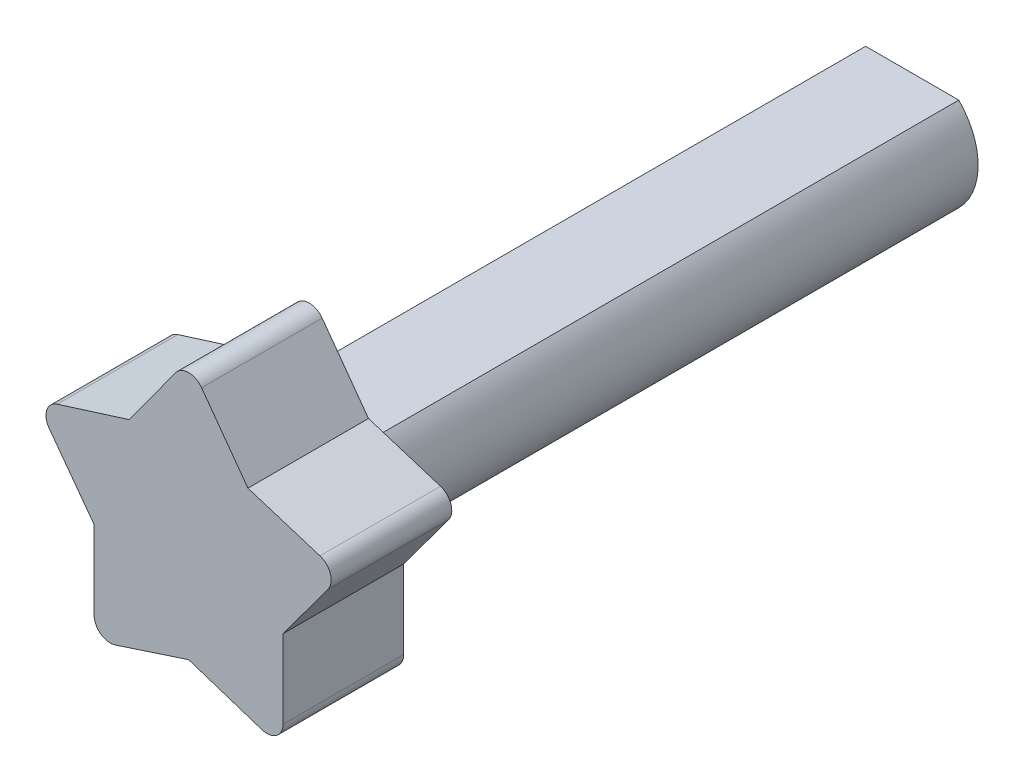
ISO-10303-21;
HEADER;
FILE_DESCRIPTION(('STEP AP214'),'2;1');
FILE_NAME('part.step','',(''),(''),'','','');
FILE_SCHEMA(('AUTOMOTIVE_DESIGN { 1 0 10303 214 1 1 1 1 }'));
ENDSEC;
DATA;
#1=APPLICATION_CONTEXT('core data for automotive mechanical design processes');
#2=APPLICATION_PROTOCOL_DEFINITION('international standard','automotive_design',2000,#1);
#3=PRODUCT_CONTEXT('',#1,'mechanical');
#4=PRODUCT('Part','Part','',(#3));
#5=PRODUCT_RELATED_PRODUCT_CATEGORY('part','',(#4));
#6=PRODUCT_DEFINITION_FORMATION('','',#4);
#7=PRODUCT_DEFINITION_CONTEXT('part definition',#1,'design');
#8=PRODUCT_DEFINITION('design','',#6,#7);
#9=PRODUCT_DEFINITION_SHAPE('','',#8);
#10=(LENGTH_UNIT() NAMED_UNIT(*) SI_UNIT(.MILLI.,.METRE.));
#11=(NAMED_UNIT(*) PLANE_ANGLE_UNIT() SI_UNIT($,.RADIAN.));
#12=(NAMED_UNIT(*) SI_UNIT($,.STERADIAN.) SOLID_ANGLE_UNIT());
#13=UNCERTAINTY_MEASURE_WITH_UNIT(LENGTH_MEASURE(1.E-05),#10,'distance_accuracy_value','');
#14=(GEOMETRIC_REPRESENTATION_CONTEXT(3) GLOBAL_UNCERTAINTY_ASSIGNED_CONTEXT((#13)) GLOBAL_UNIT_ASSIGNED_CONTEXT((#10,
#11,#12)) REPRESENTATION_CONTEXT('',''));
#15=CARTESIAN_POINT('',(0.,0.,0.));
#16=DIRECTION('',(0.,0.,1.));
#17=DIRECTION('',(1.,0.,0.));
#18=AXIS2_PLACEMENT_3D('',#15,#16,#17);
#19=CARTESIAN_POINT('',(0.0183730462436187,0.0659208005755266,-114.3));
#20=DIRECTION('',(0.,0.,1.));
#21=DIRECTION('',(1.,0.,0.));
#22=AXIS2_PLACEMENT_3D('',#19,#20,#21);
#23=CYLINDRICAL_SURFACE('',#22,10.414);
#24=DIRECTION('',(0.,0.,1.));
#25=VECTOR('',#24,1.);
#26=CARTESIAN_POINT('',(7.37782542910922,7.43408587909636,-114.3));
#27=LINE('',#26,#25);
#28=CARTESIAN_POINT('',(7.37782542910922,7.43408587909636,-114.3));
#29=VERTEX_POINT('',#28);
#30=CARTESIAN_POINT('',(7.37782542910922,7.43408587909636,-19.05));
#31=VERTEX_POINT('',#30);
#32=EDGE_CURVE('E44',#29,#31,#27,.T.);
#33=ORIENTED_EDGE('',*,*,#32,.T.);
#34=CARTESIAN_POINT('',(0.0183730462436187,0.0659208005755266,-19.05));
#35=DIRECTION('',(0.,0.,1.));
#36=DIRECTION('',(1.,0.,0.));
#37=AXIS2_PLACEMENT_3D('',#34,#35,#36);
#38=CIRCLE('',#37,10.414);
#39=CARTESIAN_POINT('',(7.37782542910922,-7.3022442779453,-19.05));
#40=VERTEX_POINT('',#39);
#41=EDGE_CURVE('E58',#40,#31,#38,.T.);
#42=ORIENTED_EDGE('',*,*,#41,.F.);
#43=DIRECTION('',(0.,0.,1.));
#44=VECTOR('',#43,1.);
#45=CARTESIAN_POINT('',(7.37782542910922,-7.3022442779453,-114.3));
#46=LINE('',#45,#44);
#47=CARTESIAN_POINT('',(7.37782542910922,-7.3022442779453,-114.3));
#48=VERTEX_POINT('',#47);
#49=EDGE_CURVE('E11',#48,#40,#46,.T.);
#50=ORIENTED_EDGE('',*,*,#49,.F.);
#51=CARTESIAN_POINT('',(0.0183730462436187,0.0659208005755266,-114.3));
#52=DIRECTION('',(0.,0.,1.));
#53=DIRECTION('',(1.,0.,0.));
#54=AXIS2_PLACEMENT_3D('',#51,#52,#53);
#55=CIRCLE('',#54,10.414);
#56=EDGE_CURVE('E315',#48,#29,#55,.T.);
#57=ORIENTED_EDGE('',*,*,#56,.T.);
#58=EDGE_LOOP('',(#33,#42,#50,#57));
#59=FACE_BOUND('',#58,.T.);
#60=ADVANCED_FACE('F41',(#59),#23,.T.);
#61=CARTESIAN_POINT('',(-7.34107933662198,-7.3022442779453,-114.3));
#62=DIRECTION('',(0.,-1.,0.));
#63=DIRECTION('',(0.,0.,-1.));
#64=AXIS2_PLACEMENT_3D('',#61,#62,#63);
#65=PLANE('',#64);
#66=ORIENTED_EDGE('',*,*,#49,.T.);
#67=DIRECTION('',(1.,0.,0.));
#68=VECTOR('',#67,1.);
#69=CARTESIAN_POINT('',(0.,-7.3022442779453,-19.05));
#70=LINE('',#69,#68);
#71=CARTESIAN_POINT('',(-7.34107933662199,-7.3022442779453,-19.05));
#72=VERTEX_POINT('',#71);
#73=EDGE_CURVE('E185',#72,#40,#70,.T.);
#74=ORIENTED_EDGE('',*,*,#73,.F.);
#75=DIRECTION('',(0.,0.,1.));
#76=VECTOR('',#75,1.);
#77=CARTESIAN_POINT('',(-7.34107933662199,-7.3022442779453,-114.3));
#78=LINE('',#77,#76);
#79=CARTESIAN_POINT('',(-7.34107933662199,-7.3022442779453,-114.3));
#80=VERTEX_POINT('',#79);
#81=EDGE_CURVE('E50',#80,#72,#78,.T.);
#82=ORIENTED_EDGE('',*,*,#81,.F.);
#83=DIRECTION('',(1.,0.,0.));
#84=VECTOR('',#83,1.);
#85=CARTESIAN_POINT('',(-7.34107933662198,-7.3022442779453,-114.3));
#86=LINE('',#85,#84);
#87=EDGE_CURVE('E365',#80,#48,#86,.T.);
#88=ORIENTED_EDGE('',*,*,#87,.T.);
#89=EDGE_LOOP('',(#66,#74,#82,#88));
#90=FACE_BOUND('',#89,.T.);
#91=ADVANCED_FACE('F388',(#90),#65,.T.);
#92=CARTESIAN_POINT('',(0.0183730462436187,0.0659208005755266,-114.3));
#93=DIRECTION('',(0.,0.,1.));
#94=DIRECTION('',(1.,0.,0.));
#95=AXIS2_PLACEMENT_3D('',#92,#93,#94);
#96=CYLINDRICAL_SURFACE('',#95,10.414);
#97=ORIENTED_EDGE('',*,*,#81,.T.);
#98=CARTESIAN_POINT('',(0.0183730462436187,0.0659208005755266,-19.05));
#99=DIRECTION('',(0.,0.,1.));
#100=DIRECTION('',(1.,0.,0.));
#101=AXIS2_PLACEMENT_3D('',#98,#99,#100);
#102=CIRCLE('',#101,10.414);
#103=CARTESIAN_POINT('',(-7.34107933662198,7.43408587909635,-19.05));
#104=VERTEX_POINT('',#103);
#105=EDGE_CURVE('E252',#104,#72,#102,.T.);
#106=ORIENTED_EDGE('',*,*,#105,.F.);
#107=DIRECTION('',(0.,0.,1.));
#108=VECTOR('',#107,1.);
#109=CARTESIAN_POINT('',(-7.34107933662198,7.43408587909636,-114.3));
#110=LINE('',#109,#108);
#111=CARTESIAN_POINT('',(-7.34107933662198,7.43408587909636,-114.3));
#112=VERTEX_POINT('',#111);
#113=EDGE_CURVE('E371',#112,#104,#110,.T.);
#114=ORIENTED_EDGE('',*,*,#113,.F.);
#115=CARTESIAN_POINT('',(0.0183730462436187,0.0659208005755266,-114.3));
#116=DIRECTION('',(0.,0.,1.));
#117=DIRECTION('',(1.,0.,0.));
#118=AXIS2_PLACEMENT_3D('',#115,#116,#117);
#119=CIRCLE('',#118,10.414);
#120=EDGE_CURVE('E361',#112,#80,#119,.T.);
#121=ORIENTED_EDGE('',*,*,#120,.T.);
#122=EDGE_LOOP('',(#97,#106,#114,#121));
#123=FACE_BOUND('',#122,.T.);
#124=ADVANCED_FACE('F384',(#123),#96,.T.);
#125=CARTESIAN_POINT('',(-7.34107933662198,7.43408587909636,-114.3));
#126=DIRECTION('',(0.,1.,0.));
#127=DIRECTION('',(0.,0.,1.));
#128=AXIS2_PLACEMENT_3D('',#125,#126,#127);
#129=PLANE('',#128);
#130=ORIENTED_EDGE('',*,*,#113,.T.);
#131=DIRECTION('',(-1.,0.,0.));
#132=VECTOR('',#131,1.);
#133=CARTESIAN_POINT('',(0.,7.43408587909636,-19.05));
#134=LINE('',#133,#132);
#135=EDGE_CURVE('E255',#31,#104,#134,.T.);
#136=ORIENTED_EDGE('',*,*,#135,.F.);
#137=ORIENTED_EDGE('',*,*,#32,.F.);
#138=DIRECTION('',(-1.,0.,0.));
#139=VECTOR('',#138,1.);
#140=CARTESIAN_POINT('',(-7.34107933662198,7.43408587909636,-114.3));
#141=LINE('',#140,#139);
#142=EDGE_CURVE('E357',#29,#112,#141,.T.);
#143=ORIENTED_EDGE('',*,*,#142,.T.);
#144=EDGE_LOOP('',(#130,#136,#137,#143));
#145=FACE_BOUND('',#144,.T.);
#146=ADVANCED_FACE('F378',(#145),#129,.T.);
#147=CARTESIAN_POINT('',(0.0183730462436187,0.0659208005755266,-114.3));
#148=DIRECTION('',(0.,0.,1.));
#149=DIRECTION('',(1.,0.,0.));
#150=AXIS2_PLACEMENT_3D('',#147,#148,#149);
#151=PLANE('',#150);
#152=ORIENTED_EDGE('',*,*,#56,.F.);
#153=ORIENTED_EDGE('',*,*,#87,.F.);
#154=ORIENTED_EDGE('',*,*,#120,.F.);
#155=ORIENTED_EDGE('',*,*,#142,.F.);
#156=EDGE_LOOP('',(#152,#153,#154,#155));
#157=FACE_BOUND('',#156,.T.);
#158=ADVANCED_FACE('F381',(#157),#151,.F.);
#159=CARTESIAN_POINT('',(0.,21.0692264092509,-19.05));
#160=DIRECTION('',(0.,0.,1.));
#161=DIRECTION('',(1.,0.,0.));
#162=AXIS2_PLACEMENT_3D('',#159,#160,#161);
#163=CYLINDRICAL_SURFACE('',#162,2.54);
#164=CARTESIAN_POINT('',(0.,21.0692264092509,0.));
#165=DIRECTION('',(0.,0.,1.));
#166=DIRECTION('',(1.,0.,0.));
#167=AXIS2_PLACEMENT_3D('',#164,#165,#166);
#168=CIRCLE('',#167,2.54);
#169=CARTESIAN_POINT('',(2.05490316571237,22.5622009500738,0.));
#170=VERTEX_POINT('',#169);
#171=CARTESIAN_POINT('',(-2.05490316571239,22.5622009500738,0.));
#172=VERTEX_POINT('',#171);
#173=EDGE_CURVE('E262',#170,#172,#168,.T.);
#174=ORIENTED_EDGE('',*,*,#173,.F.);
#175=DIRECTION('',(0.,0.,1.));
#176=VECTOR('',#175,1.);
#177=CARTESIAN_POINT('',(2.05490316571237,22.5622009500738,-19.05));
#178=LINE('',#177,#176);
#179=CARTESIAN_POINT('',(2.05490316571237,22.5622009500738,-19.05));
#180=VERTEX_POINT('',#179);
#181=EDGE_CURVE('E197',#180,#170,#178,.T.);
#182=ORIENTED_EDGE('',*,*,#181,.F.);
#183=CARTESIAN_POINT('',(0.,21.0692264092509,-19.05));
#184=DIRECTION('',(0.,0.,1.));
#185=DIRECTION('',(1.,0.,0.));
#186=AXIS2_PLACEMENT_3D('',#183,#184,#185);
#187=CIRCLE('',#186,2.54);
#188=CARTESIAN_POINT('',(-2.05490316571239,22.5622009500738,-19.05));
#189=VERTEX_POINT('',#188);
#190=EDGE_CURVE('E190',#180,#189,#187,.T.);
#191=ORIENTED_EDGE('',*,*,#190,.T.);
#192=DIRECTION('',(0.,0.,1.));
#193=VECTOR('',#192,1.);
#194=CARTESIAN_POINT('',(-2.05490316571239,22.5622009500738,-19.05));
#195=LINE('',#194,#193);
#196=EDGE_CURVE('E173',#189,#172,#195,.T.);
#197=ORIENTED_EDGE('',*,*,#196,.T.);
#198=EDGE_LOOP('',(#174,#182,#191,#197));
#199=FACE_BOUND('',#198,.T.);
#200=ADVANCED_FACE('F196',(#199),#163,.T.);
#201=CARTESIAN_POINT('',(12.0739157006204,8.77221323605231,-19.05));
#202=DIRECTION('',(-0.809016994374948,-0.587785252292472,0.));
#203=DIRECTION('',(0.587785252292472,-0.809016994374948,0.));
#204=AXIS2_PLACEMENT_3D('',#201,#202,#203);
#205=PLANE('',#204);
#206=DIRECTION('',(0.587785252292472,-0.809016994374948,0.));
#207=VECTOR('',#206,1.);
#208=CARTESIAN_POINT('',(12.0739157006204,8.77221323605231,0.));
#209=LINE('',#208,#207);
#210=CARTESIAN_POINT('',(9.37321435239456,12.4894097443425,0.));
#211=VERTEX_POINT('',#210);
#212=EDGE_CURVE('E200',#170,#211,#209,.T.);
#213=ORIENTED_EDGE('',*,*,#212,.T.);
#214=DIRECTION('',(0.,0.,1.));
#215=VECTOR('',#214,1.);
#216=CARTESIAN_POINT('',(9.37321435239456,12.4894097443425,-19.05));
#217=LINE('',#216,#215);
#218=CARTESIAN_POINT('',(9.37321435239456,12.4894097443425,-19.05));
#219=VERTEX_POINT('',#218);
#220=EDGE_CURVE('E316',#219,#211,#217,.T.);
#221=ORIENTED_EDGE('',*,*,#220,.F.);
#222=DIRECTION('',(0.587785252292472,-0.809016994374948,0.));
#223=VECTOR('',#222,1.);
#224=CARTESIAN_POINT('',(12.0739157006204,8.77221323605231,-19.05));
#225=LINE('',#224,#223);
#226=EDGE_CURVE('E249',#180,#219,#225,.T.);
#227=ORIENTED_EDGE('',*,*,#226,.F.);
#228=ORIENTED_EDGE('',*,*,#181,.T.);
#229=EDGE_LOOP('',(#213,#221,#227,#228));
#230=FACE_BOUND('',#229,.T.);
#231=ADVANCED_FACE('F406',(#230),#205,.F.);
#232=CARTESIAN_POINT('',(4.41485215354041,14.047702691738,-19.05));
#233=DIRECTION('',(0.299817936372512,0.953996438687969,0.));
#234=DIRECTION('',(-0.953996438687969,0.299817936372512,0.));
#235=AXIS2_PLACEMENT_3D('',#232,#233,#234);
#236=PLANE('',#235);
#237=DIRECTION('',(-0.953996438687969,0.299817936372512,0.));
#238=VECTOR('',#237,1.);
#239=CARTESIAN_POINT('',(4.41485215354041,14.047702691738,0.));
#240=LINE('',#239,#238);
#241=CARTESIAN_POINT('',(20.7505298588902,8.91379549854107,0.));
#242=VERTEX_POINT('',#241);
#243=EDGE_CURVE('E204',#242,#211,#240,.T.);
#244=ORIENTED_EDGE('',*,*,#243,.F.);
#245=DIRECTION('',(0.,0.,1.));
#246=VECTOR('',#245,1.);
#247=CARTESIAN_POINT('',(20.7505298588902,8.91379549854107,-19.05));
#248=LINE('',#247,#246);
#249=CARTESIAN_POINT('',(20.7505298588902,8.91379549854107,-19.05));
#250=VERTEX_POINT('',#249);
#251=EDGE_CURVE('E319',#250,#242,#248,.T.);
#252=ORIENTED_EDGE('',*,*,#251,.F.);
#253=DIRECTION('',(-0.953996438687969,0.299817936372512,0.));
#254=VECTOR('',#253,1.);
#255=CARTESIAN_POINT('',(4.41485215354041,14.047702691738,-19.05));
#256=LINE('',#255,#254);
#257=EDGE_CURVE('E245',#250,#219,#256,.T.);
#258=ORIENTED_EDGE('',*,*,#257,.T.);
#259=ORIENTED_EDGE('',*,*,#220,.T.);
#260=EDGE_LOOP('',(#244,#252,#258,#259));
#261=FACE_BOUND('',#260,.T.);
#262=ADVANCED_FACE('F454',(#261),#236,.T.);
#263=CARTESIAN_POINT('',(19.988992300504,6.49064454427362,-19.05));
#264=DIRECTION('',(0.,0.,1.));
#265=DIRECTION('',(1.,0.,0.));
#266=AXIS2_PLACEMENT_3D('',#263,#264,#265);
#267=CYLINDRICAL_SURFACE('',#266,2.54);
#268=CARTESIAN_POINT('',(19.988992300504,6.49064454427362,0.));
#269=DIRECTION('',(0.,0.,1.));
#270=DIRECTION('',(1.,0.,0.));
#271=AXIS2_PLACEMENT_3D('',#268,#269,#270);
#272=CIRCLE('',#271,2.54);
#273=CARTESIAN_POINT('',(22.0321231029114,4.98159963962222,0.));
#274=VERTEX_POINT('',#273);
#275=EDGE_CURVE('E306',#274,#242,#272,.T.);
#276=ORIENTED_EDGE('',*,*,#275,.F.);
#277=DIRECTION('',(0.,0.,1.));
#278=VECTOR('',#277,1.);
#279=CARTESIAN_POINT('',(22.0321231029114,4.98159963962222,-19.05));
#280=LINE('',#279,#278);
#281=CARTESIAN_POINT('',(22.0321231029114,4.98159963962222,-19.05));
#282=VERTEX_POINT('',#281);
#283=EDGE_CURVE('E322',#282,#274,#280,.T.);
#284=ORIENTED_EDGE('',*,*,#283,.F.);
#285=CARTESIAN_POINT('',(19.988992300504,6.49064454427362,-19.05));
#286=DIRECTION('',(0.,0.,1.));
#287=DIRECTION('',(1.,0.,0.));
#288=AXIS2_PLACEMENT_3D('',#285,#286,#287);
#289=CIRCLE('',#288,2.54);
#290=EDGE_CURVE('E241',#282,#250,#289,.T.);
#291=ORIENTED_EDGE('',*,*,#290,.T.);
#292=ORIENTED_EDGE('',*,*,#251,.T.);
#293=EDGE_LOOP('',(#276,#284,#291,#292));
#294=FACE_BOUND('',#293,.T.);
#295=ADVANCED_FACE('F450',(#294),#267,.T.);
#296=CARTESIAN_POINT('',(11.8747878872972,-8.77065146001795,-19.05));
#297=DIRECTION('',(-0.804382205672187,0.594112167185581,0.));
#298=DIRECTION('',(-0.594112167185581,-0.804382205672187,0.));
#299=AXIS2_PLACEMENT_3D('',#296,#297,#298);
#300=PLANE('',#299);
#301=DIRECTION('',(-0.594112167185581,-0.804382205672187,0.));
#302=VECTOR('',#301,1.);
#303=CARTESIAN_POINT('',(11.8747878872972,-8.77065146001795,0.));
#304=LINE('',#303,#302);
#305=CARTESIAN_POINT('',(14.9241805605687,-4.64200818360349,0.));
#306=VERTEX_POINT('',#305);
#307=EDGE_CURVE('E302',#274,#306,#304,.T.);
#308=ORIENTED_EDGE('',*,*,#307,.T.);
#309=DIRECTION('',(0.,0.,1.));
#310=VECTOR('',#309,1.);
#311=CARTESIAN_POINT('',(14.9241805605687,-4.64200818360349,-19.05));
#312=LINE('',#311,#310);
#313=CARTESIAN_POINT('',(14.9241805605687,-4.64200818360349,-19.05));
#314=VERTEX_POINT('',#313);
#315=EDGE_CURVE('E325',#314,#306,#312,.T.);
#316=ORIENTED_EDGE('',*,*,#315,.F.);
#317=DIRECTION('',(-0.594112167185581,-0.804382205672187,0.));
#318=VECTOR('',#317,1.);
#319=CARTESIAN_POINT('',(11.8747878872972,-8.77065146001795,-19.05));
#320=LINE('',#319,#318);
#321=EDGE_CURVE('E238',#282,#314,#320,.T.);
#322=ORIENTED_EDGE('',*,*,#321,.F.);
#323=ORIENTED_EDGE('',*,*,#283,.T.);
#324=EDGE_LOOP('',(#308,#316,#322,#323));
#325=FACE_BOUND('',#324,.T.);
#326=ADVANCED_FACE('F446',(#325),#300,.F.);
#327=CARTESIAN_POINT('',(14.9241805605687,0.,-19.05));
#328=DIRECTION('',(1.,0.,0.));
#329=DIRECTION('',(0.,0.,-1.));
#330=AXIS2_PLACEMENT_3D('',#327,#328,#329);
#331=PLANE('',#330);
#332=DIRECTION('',(0.,1.,0.));
#333=VECTOR('',#332,1.);
#334=CARTESIAN_POINT('',(14.9241805605687,0.,0.));
#335=LINE('',#334,#333);
#336=CARTESIAN_POINT('',(14.9241805605687,-17.0385844841447,0.));
#337=VERTEX_POINT('',#336);
#338=EDGE_CURVE('E298',#337,#306,#335,.T.);
#339=ORIENTED_EDGE('',*,*,#338,.F.);
#340=DIRECTION('',(0.,0.,1.));
#341=VECTOR('',#340,1.);
#342=CARTESIAN_POINT('',(14.9241805605687,-17.0385844841447,-19.05));
#343=LINE('',#342,#341);
#344=CARTESIAN_POINT('',(14.9241805605687,-17.0385844841447,-19.05));
#345=VERTEX_POINT('',#344);
#346=EDGE_CURVE('E328',#345,#337,#343,.T.);
#347=ORIENTED_EDGE('',*,*,#346,.F.);
#348=DIRECTION('',(0.,1.,0.));
#349=VECTOR('',#348,1.);
#350=CARTESIAN_POINT('',(14.9241805605687,0.,-19.05));
#351=LINE('',#350,#349);
#352=EDGE_CURVE('E234',#345,#314,#351,.T.);
#353=ORIENTED_EDGE('',*,*,#352,.T.);
#354=ORIENTED_EDGE('',*,*,#315,.T.);
#355=EDGE_LOOP('',(#339,#347,#353,#354));
#356=FACE_BOUND('',#355,.T.);
#357=ADVANCED_FACE('F442',(#356),#331,.T.);
#358=CARTESIAN_POINT('',(12.3841805605687,-17.0385844841447,-19.05));
#359=DIRECTION('',(0.,0.,1.));
#360=DIRECTION('',(1.,0.,0.));
#361=AXIS2_PLACEMENT_3D('',#358,#359,#360);
#362=CYLINDRICAL_SURFACE('',#361,2.54);
#363=CARTESIAN_POINT('',(12.3841805605687,-17.0385844841447,0.));
#364=DIRECTION('',(0.,0.,1.));
#365=DIRECTION('',(1.,0.,0.));
#366=AXIS2_PLACEMENT_3D('',#363,#364,#365);
#367=CIRCLE('',#366,2.54);
#368=CARTESIAN_POINT('',(11.5948302885743,-19.4528185548393,0.));
#369=VERTEX_POINT('',#368);
#370=EDGE_CURVE('E294',#369,#337,#367,.T.);
#371=ORIENTED_EDGE('',*,*,#370,.F.);
#372=DIRECTION('',(0.,0.,1.));
#373=VECTOR('',#372,1.);
#374=CARTESIAN_POINT('',(11.5948302885743,-19.4528185548393,-19.05));
#375=LINE('',#374,#373);
#376=CARTESIAN_POINT('',(11.5948302885743,-19.4528185548393,-19.05));
#377=VERTEX_POINT('',#376);
#378=EDGE_CURVE('E331',#377,#369,#375,.T.);
#379=ORIENTED_EDGE('',*,*,#378,.F.);
#380=CARTESIAN_POINT('',(12.3841805605687,-17.0385844841447,-19.05));
#381=DIRECTION('',(0.,0.,1.));
#382=DIRECTION('',(1.,0.,0.));
#383=AXIS2_PLACEMENT_3D('',#380,#381,#382);
#384=CIRCLE('',#383,2.54);
#385=EDGE_CURVE('E230',#377,#345,#384,.T.);
#386=ORIENTED_EDGE('',*,*,#385,.T.);
#387=ORIENTED_EDGE('',*,*,#346,.T.);
#388=EDGE_LOOP('',(#371,#379,#386,#387));
#389=FACE_BOUND('',#388,.T.);
#390=ADVANCED_FACE('F438',(#389),#362,.T.);
#391=CARTESIAN_POINT('',(-4.62619197009016,-14.1492448511424,-19.05));
#392=DIRECTION('',(0.310767823619857,0.950485854604148,0.));
#393=DIRECTION('',(-0.950485854604148,0.310767823619857,0.));
#394=AXIS2_PLACEMENT_3D('',#391,#392,#393);
#395=PLANE('',#394);
#396=DIRECTION('',(-0.950485854604148,0.310767823619857,0.));
#397=VECTOR('',#396,1.);
#398=CARTESIAN_POINT('',(-4.62619197009016,-14.1492448511424,0.));
#399=LINE('',#398,#397);
#400=CARTESIAN_POINT('',(-1.51788304147971E-13,-15.6618098232863,0.));
#401=VERTEX_POINT('',#400);
#402=EDGE_CURVE('E290',#369,#401,#399,.T.);
#403=ORIENTED_EDGE('',*,*,#402,.T.);
#404=DIRECTION('',(0.,0.,1.));
#405=VECTOR('',#404,1.);
#406=CARTESIAN_POINT('',(-1.51788304147971E-13,-15.6618098232863,-19.05));
#407=LINE('',#406,#405);
#408=CARTESIAN_POINT('',(-1.51788304147971E-13,-15.6618098232863,-19.05));
#409=VERTEX_POINT('',#408);
#410=EDGE_CURVE('E334',#409,#401,#407,.T.);
#411=ORIENTED_EDGE('',*,*,#410,.F.);
#412=DIRECTION('',(-0.950485854604148,0.310767823619857,0.));
#413=VECTOR('',#412,1.);
#414=CARTESIAN_POINT('',(-4.62619197009016,-14.1492448511424,-19.05));
#415=LINE('',#414,#413);
#416=EDGE_CURVE('E227',#377,#409,#415,.T.);
#417=ORIENTED_EDGE('',*,*,#416,.F.);
#418=ORIENTED_EDGE('',*,*,#378,.T.);
#419=EDGE_LOOP('',(#403,#411,#417,#418));
#420=FACE_BOUND('',#419,.T.);
#421=ADVANCED_FACE('F434',(#420),#395,.F.);
#422=CARTESIAN_POINT('',(4.62619197009007,-14.1492448511423,-19.05));
#423=DIRECTION('',(0.310767823619853,-0.950485854604149,0.));
#424=DIRECTION('',(0.950485854604149,0.310767823619853,0.));
#425=AXIS2_PLACEMENT_3D('',#422,#423,#424);
#426=PLANE('',#425);
#427=DIRECTION('',(0.950485854604149,0.310767823619853,0.));
#428=VECTOR('',#427,1.);
#429=CARTESIAN_POINT('',(4.62619197009007,-14.1492448511423,0.));
#430=LINE('',#429,#428);
#431=CARTESIAN_POINT('',(-11.5948302885744,-19.4528185548392,0.));
#432=VERTEX_POINT('',#431);
#433=EDGE_CURVE('E286',#432,#401,#430,.T.);
#434=ORIENTED_EDGE('',*,*,#433,.F.);
#435=DIRECTION('',(0.,0.,1.));
#436=VECTOR('',#435,1.);
#437=CARTESIAN_POINT('',(-11.5948302885744,-19.4528185548392,-19.05));
#438=LINE('',#437,#436);
#439=CARTESIAN_POINT('',(-11.5948302885744,-19.4528185548392,-19.05));
#440=VERTEX_POINT('',#439);
#441=EDGE_CURVE('E337',#440,#432,#438,.T.);
#442=ORIENTED_EDGE('',*,*,#441,.F.);
#443=DIRECTION('',(0.950485854604149,0.310767823619853,0.));
#444=VECTOR('',#443,1.);
#445=CARTESIAN_POINT('',(4.62619197009007,-14.1492448511423,-19.05));
#446=LINE('',#445,#444);
#447=EDGE_CURVE('E223',#440,#409,#446,.T.);
#448=ORIENTED_EDGE('',*,*,#447,.T.);
#449=ORIENTED_EDGE('',*,*,#410,.T.);
#450=EDGE_LOOP('',(#434,#442,#448,#449));
#451=FACE_BOUND('',#450,.T.);
#452=ADVANCED_FACE('F430',(#451),#426,.T.);
#453=CARTESIAN_POINT('',(-12.3841805605689,-17.0385844841446,-19.05));
#454=DIRECTION('',(0.,0.,1.));
#455=DIRECTION('',(1.,0.,0.));
#456=AXIS2_PLACEMENT_3D('',#453,#454,#455);
#457=CYLINDRICAL_SURFACE('',#456,2.54);
#458=CARTESIAN_POINT('',(-12.3841805605689,-17.0385844841446,0.));
#459=DIRECTION('',(0.,0.,1.));
#460=DIRECTION('',(1.,0.,0.));
#461=AXIS2_PLACEMENT_3D('',#458,#459,#460);
#462=CIRCLE('',#461,2.54);
#463=CARTESIAN_POINT('',(-14.9241805605689,-17.0385844841446,0.));
#464=VERTEX_POINT('',#463);
#465=EDGE_CURVE('E282',#464,#432,#462,.T.);
#466=ORIENTED_EDGE('',*,*,#465,.F.);
#467=DIRECTION('',(0.,0.,1.));
#468=VECTOR('',#467,1.);
#469=CARTESIAN_POINT('',(-14.9241805605689,-17.0385844841446,-19.05));
#470=LINE('',#469,#468);
#471=CARTESIAN_POINT('',(-14.9241805605689,-17.0385844841446,-19.05));
#472=VERTEX_POINT('',#471);
#473=EDGE_CURVE('E340',#472,#464,#470,.T.);
#474=ORIENTED_EDGE('',*,*,#473,.F.);
#475=CARTESIAN_POINT('',(-12.3841805605689,-17.0385844841446,-19.05));
#476=DIRECTION('',(0.,0.,1.));
#477=DIRECTION('',(1.,0.,0.));
#478=AXIS2_PLACEMENT_3D('',#475,#476,#477);
#479=CIRCLE('',#478,2.54);
#480=EDGE_CURVE('E219',#472,#440,#479,.T.);
#481=ORIENTED_EDGE('',*,*,#480,.T.);
#482=ORIENTED_EDGE('',*,*,#441,.T.);
#483=EDGE_LOOP('',(#466,#474,#481,#482));
#484=FACE_BOUND('',#483,.T.);
#485=ADVANCED_FACE('F426',(#484),#457,.T.);
#486=CARTESIAN_POINT('',(-14.9241805605689,0.,-19.05));
#487=DIRECTION('',(1.,0.,0.));
#488=DIRECTION('',(0.,0.,-1.));
#489=AXIS2_PLACEMENT_3D('',#486,#487,#488);
#490=PLANE('',#489);
#491=DIRECTION('',(0.,1.,0.));
#492=VECTOR('',#491,1.);
#493=CARTESIAN_POINT('',(-14.9241805605689,0.,0.));
#494=LINE('',#493,#492);
#495=CARTESIAN_POINT('',(-14.9241805605689,-4.6420081836035,0.));
#496=VERTEX_POINT('',#495);
#497=EDGE_CURVE('E278',#464,#496,#494,.T.);
#498=ORIENTED_EDGE('',*,*,#497,.T.);
#499=DIRECTION('',(0.,0.,1.));
#500=VECTOR('',#499,1.);
#501=CARTESIAN_POINT('',(-14.9241805605689,-4.6420081836035,-19.05));
#502=LINE('',#501,#500);
#503=CARTESIAN_POINT('',(-14.9241805605689,-4.6420081836035,-19.05));
#504=VERTEX_POINT('',#503);
#505=EDGE_CURVE('E343',#504,#496,#502,.T.);
#506=ORIENTED_EDGE('',*,*,#505,.F.);
#507=DIRECTION('',(0.,1.,0.));
#508=VECTOR('',#507,1.);
#509=CARTESIAN_POINT('',(-14.9241805605689,0.,-19.05));
#510=LINE('',#509,#508);
#511=EDGE_CURVE('E216',#472,#504,#510,.T.);
#512=ORIENTED_EDGE('',*,*,#511,.F.);
#513=ORIENTED_EDGE('',*,*,#473,.T.);
#514=EDGE_LOOP('',(#498,#506,#512,#513));
#515=FACE_BOUND('',#514,.T.);
#516=ADVANCED_FACE('F422',(#515),#490,.F.);
#517=CARTESIAN_POINT('',(-11.8747878872973,-8.77065146001805,-19.05));
#518=DIRECTION('',(-0.804382205672186,-0.594112167185582,0.));
#519=DIRECTION('',(0.594112167185583,-0.804382205672186,0.));
#520=AXIS2_PLACEMENT_3D('',#517,#518,#519);
#521=PLANE('',#520);
#522=DIRECTION('',(0.594112167185582,-0.804382205672186,0.));
#523=VECTOR('',#522,1.);
#524=CARTESIAN_POINT('',(-11.8747878872973,-8.77065146001805,0.));
#525=LINE('',#524,#523);
#526=CARTESIAN_POINT('',(-22.0321231029114,4.98159963962206,0.));
#527=VERTEX_POINT('',#526);
#528=EDGE_CURVE('E274',#527,#496,#525,.T.);
#529=ORIENTED_EDGE('',*,*,#528,.F.);
#530=DIRECTION('',(0.,0.,1.));
#531=VECTOR('',#530,1.);
#532=CARTESIAN_POINT('',(-22.0321231029114,4.98159963962206,-19.05));
#533=LINE('',#532,#531);
#534=CARTESIAN_POINT('',(-22.0321231029114,4.98159963962206,-19.05));
#535=VERTEX_POINT('',#534);
#536=EDGE_CURVE('E346',#535,#527,#533,.T.);
#537=ORIENTED_EDGE('',*,*,#536,.F.);
#538=DIRECTION('',(0.594112167185582,-0.804382205672186,0.));
#539=VECTOR('',#538,1.);
#540=CARTESIAN_POINT('',(-11.8747878872973,-8.77065146001805,-19.05));
#541=LINE('',#540,#539);
#542=EDGE_CURVE('E212',#535,#504,#541,.T.);
#543=ORIENTED_EDGE('',*,*,#542,.T.);
#544=ORIENTED_EDGE('',*,*,#505,.T.);
#545=EDGE_LOOP('',(#529,#537,#543,#544));
#546=FACE_BOUND('',#545,.T.);
#547=ADVANCED_FACE('F418',(#546),#521,.T.);
#548=CARTESIAN_POINT('',(-19.9889923005041,6.49064454427346,-19.05));
#549=DIRECTION('',(0.,0.,1.));
#550=DIRECTION('',(1.,0.,0.));
#551=AXIS2_PLACEMENT_3D('',#548,#549,#550);
#552=CYLINDRICAL_SURFACE('',#551,2.54);
#553=CARTESIAN_POINT('',(-19.9889923005041,6.49064454427346,0.));
#554=DIRECTION('',(0.,0.,1.));
#555=DIRECTION('',(1.,0.,0.));
#556=AXIS2_PLACEMENT_3D('',#553,#554,#555);
#557=CIRCLE('',#556,2.54);
#558=CARTESIAN_POINT('',(-20.7505298588903,8.9137954985409,0.));
#559=VERTEX_POINT('',#558);
#560=EDGE_CURVE('E271',#527,#559,#557,.F.);
#561=ORIENTED_EDGE('',*,*,#560,.T.);
#562=DIRECTION('',(0.,0.,1.));
#563=VECTOR('',#562,1.);
#564=CARTESIAN_POINT('',(-20.7505298588903,8.9137954985409,-19.05));
#565=LINE('',#564,#563);
#566=CARTESIAN_POINT('',(-20.7505298588903,8.9137954985409,-19.05));
#567=VERTEX_POINT('',#566);
#568=EDGE_CURVE('E349',#567,#559,#565,.T.);
#569=ORIENTED_EDGE('',*,*,#568,.F.);
#570=CARTESIAN_POINT('',(-19.9889923005041,6.49064454427346,-19.05));
#571=DIRECTION('',(0.,0.,1.));
#572=DIRECTION('',(1.,0.,0.));
#573=AXIS2_PLACEMENT_3D('',#570,#571,#572);
#574=CIRCLE('',#573,2.54);
#575=EDGE_CURVE('E209',#535,#567,#574,.F.);
#576=ORIENTED_EDGE('',*,*,#575,.F.);
#577=ORIENTED_EDGE('',*,*,#536,.T.);
#578=EDGE_LOOP('',(#561,#569,#576,#577));
#579=FACE_BOUND('',#578,.T.);
#580=ADVANCED_FACE('F414',(#579),#552,.T.);
#581=CARTESIAN_POINT('',(-4.41485215354049,14.0477026917379,-19.05));
#582=DIRECTION('',(0.299817936372518,-0.953996438687967,0.));
#583=DIRECTION('',(0.953996438687967,0.299817936372518,0.));
#584=AXIS2_PLACEMENT_3D('',#581,#582,#583);
#585=PLANE('',#584);
#586=DIRECTION('',(0.953996438687967,0.299817936372518,0.));
#587=VECTOR('',#586,1.);
#588=CARTESIAN_POINT('',(-4.41485215354049,14.0477026917379,0.));
#589=LINE('',#588,#587);
#590=CARTESIAN_POINT('',(-9.37321435239469,12.4894097443424,0.));
#591=VERTEX_POINT('',#590);
#592=EDGE_CURVE('E267',#559,#591,#589,.T.);
#593=ORIENTED_EDGE('',*,*,#592,.T.);
#594=DIRECTION('',(0.,0.,1.));
#595=VECTOR('',#594,1.);
#596=CARTESIAN_POINT('',(-9.37321435239469,12.4894097443424,-19.05));
#597=LINE('',#596,#595);
#598=CARTESIAN_POINT('',(-9.37321435239469,12.4894097443424,-19.05));
#599=VERTEX_POINT('',#598);
#600=EDGE_CURVE('E184',#599,#591,#597,.T.);
#601=ORIENTED_EDGE('',*,*,#600,.F.);
#602=DIRECTION('',(0.953996438687967,0.299817936372518,0.));
#603=VECTOR('',#602,1.);
#604=CARTESIAN_POINT('',(-4.41485215354049,14.0477026917379,-19.05));
#605=LINE('',#604,#603);
#606=EDGE_CURVE('E192',#567,#599,#605,.T.);
#607=ORIENTED_EDGE('',*,*,#606,.F.);
#608=ORIENTED_EDGE('',*,*,#568,.T.);
#609=EDGE_LOOP('',(#593,#601,#607,#608));
#610=FACE_BOUND('',#609,.T.);
#611=ADVANCED_FACE('F411',(#610),#585,.F.);
#612=CARTESIAN_POINT('',(-12.0739157006204,8.77221323605239,-19.05));
#613=DIRECTION('',(-0.809016994374946,0.587785252292474,0.));
#614=DIRECTION('',(-0.587785252292474,-0.809016994374946,0.));
#615=AXIS2_PLACEMENT_3D('',#612,#613,#614);
#616=PLANE('',#615);
#617=DIRECTION('',(-0.587785252292475,-0.809016994374947,0.));
#618=VECTOR('',#617,1.);
#619=CARTESIAN_POINT('',(-12.0739157006204,8.77221323605239,0.));
#620=LINE('',#619,#618);
#621=EDGE_CURVE('E178',#172,#591,#620,.T.);
#622=ORIENTED_EDGE('',*,*,#621,.F.);
#623=ORIENTED_EDGE('',*,*,#196,.F.);
#624=DIRECTION('',(-0.587785252292475,-0.809016994374947,0.));
#625=VECTOR('',#624,1.);
#626=CARTESIAN_POINT('',(-12.0739157006204,8.77221323605239,-19.05));
#627=LINE('',#626,#625);
#628=EDGE_CURVE('E176',#189,#599,#627,.T.);
#629=ORIENTED_EDGE('',*,*,#628,.T.);
#630=ORIENTED_EDGE('',*,*,#600,.T.);
#631=EDGE_LOOP('',(#622,#623,#629,#630));
#632=FACE_BOUND('',#631,.T.);
#633=ADVANCED_FACE('F175',(#632),#616,.T.);
#634=CARTESIAN_POINT('',(0.,0.,-19.05));
#635=DIRECTION('',(0.,0.,1.));
#636=DIRECTION('',(1.,0.,0.));
#637=AXIS2_PLACEMENT_3D('',#634,#635,#636);
#638=PLANE('',#637);
#639=ORIENTED_EDGE('',*,*,#190,.F.);
#640=ORIENTED_EDGE('',*,*,#226,.T.);
#641=ORIENTED_EDGE('',*,*,#257,.F.);
#642=ORIENTED_EDGE('',*,*,#290,.F.);
#643=ORIENTED_EDGE('',*,*,#321,.T.);
#644=ORIENTED_EDGE('',*,*,#352,.F.);
#645=ORIENTED_EDGE('',*,*,#385,.F.);
#646=ORIENTED_EDGE('',*,*,#416,.T.);
#647=ORIENTED_EDGE('',*,*,#447,.F.);
#648=ORIENTED_EDGE('',*,*,#480,.F.);
#649=ORIENTED_EDGE('',*,*,#511,.T.);
#650=ORIENTED_EDGE('',*,*,#542,.F.);
#651=ORIENTED_EDGE('',*,*,#575,.T.);
#652=ORIENTED_EDGE('',*,*,#606,.T.);
#653=ORIENTED_EDGE('',*,*,#628,.F.);
#654=EDGE_LOOP('',(#639,#640,#641,#642,#643,#644,#645,#646,#647,#648,#649,#650,#651,#652,#653));
#655=FACE_BOUND('',#654,.T.);
#656=ORIENTED_EDGE('',*,*,#105,.T.);
#657=ORIENTED_EDGE('',*,*,#73,.T.);
#658=ORIENTED_EDGE('',*,*,#41,.T.);
#659=ORIENTED_EDGE('',*,*,#135,.T.);
#660=EDGE_LOOP('',(#656,#657,#658,#659));
#661=FACE_BOUND('',#660,.T.);
#662=ADVANCED_FACE('F189',(#655,#661),#638,.F.);
#663=CARTESIAN_POINT('',(0.0183730462436187,0.0659208005755266,0.));
#664=DIRECTION('',(0.,0.,1.));
#665=DIRECTION('',(1.,0.,0.));
#666=AXIS2_PLACEMENT_3D('',#663,#664,#665);
#667=PLANE('',#666);
#668=ORIENTED_EDGE('',*,*,#173,.T.);
#669=ORIENTED_EDGE('',*,*,#621,.T.);
#670=ORIENTED_EDGE('',*,*,#592,.F.);
#671=ORIENTED_EDGE('',*,*,#560,.F.);
#672=ORIENTED_EDGE('',*,*,#528,.T.);
#673=ORIENTED_EDGE('',*,*,#497,.F.);
#674=ORIENTED_EDGE('',*,*,#465,.T.);
#675=ORIENTED_EDGE('',*,*,#433,.T.);
#676=ORIENTED_EDGE('',*,*,#402,.F.);
#677=ORIENTED_EDGE('',*,*,#370,.T.);
#678=ORIENTED_EDGE('',*,*,#338,.T.);
#679=ORIENTED_EDGE('',*,*,#307,.F.);
#680=ORIENTED_EDGE('',*,*,#275,.T.);
#681=ORIENTED_EDGE('',*,*,#243,.T.);
#682=ORIENTED_EDGE('',*,*,#212,.F.);
#683=EDGE_LOOP('',(#668,#669,#670,#671,#672,#673,#674,#675,#676,#677,#678,#679,#680,#681,#682));
#684=FACE_BOUND('',#683,.T.);
#685=ADVANCED_FACE('F397',(#684),#667,.T.);
#686=CLOSED_SHELL('',(#60,#91,#124,#146,#158,#200,#231,#262,#295,#326,#357,#390,#421,#452,#485,
#516,#547,#580,#611,#633,#662,#685));
#687=MANIFOLD_SOLID_BREP('B2',#686);
#688=ADVANCED_BREP_SHAPE_REPRESENTATION('',(#18,#687),#14);
#689=SHAPE_DEFINITION_REPRESENTATION(#9,#688);
ENDSEC;
END-ISO-10303-21;
